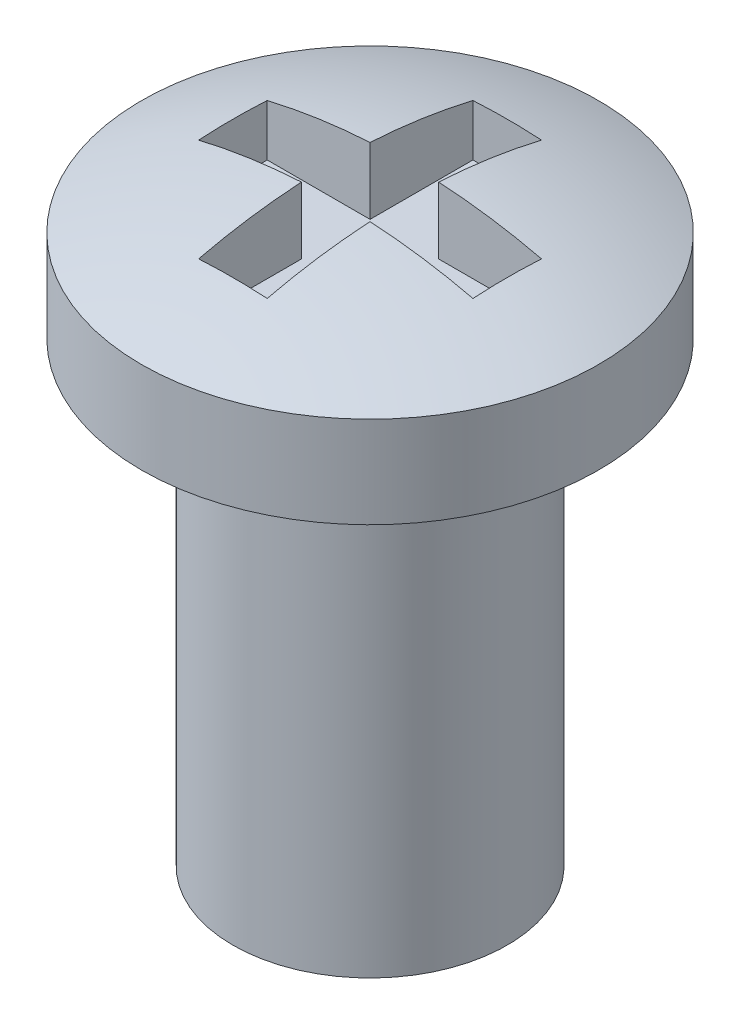
ISO-10303-21;
HEADER;
FILE_DESCRIPTION(('STEP AP214'),'2;1');
FILE_NAME('part.step','',(''),(''),'','','');
FILE_SCHEMA(('AUTOMOTIVE_DESIGN { 1 0 10303 214 1 1 1 1 }'));
ENDSEC;
DATA;
#1=APPLICATION_CONTEXT('core data for automotive mechanical design processes');
#2=APPLICATION_PROTOCOL_DEFINITION('international standard','automotive_design',2000,#1);
#3=PRODUCT_CONTEXT('',#1,'mechanical');
#4=PRODUCT('Part','Part','',(#3));
#5=PRODUCT_RELATED_PRODUCT_CATEGORY('part','',(#4));
#6=PRODUCT_DEFINITION_FORMATION('','',#4);
#7=PRODUCT_DEFINITION_CONTEXT('part definition',#1,'design');
#8=PRODUCT_DEFINITION('design','',#6,#7);
#9=PRODUCT_DEFINITION_SHAPE('','',#8);
#10=(LENGTH_UNIT() NAMED_UNIT(*) SI_UNIT(.MILLI.,.METRE.));
#11=(NAMED_UNIT(*) PLANE_ANGLE_UNIT() SI_UNIT($,.RADIAN.));
#12=(NAMED_UNIT(*) SI_UNIT($,.STERADIAN.) SOLID_ANGLE_UNIT());
#13=UNCERTAINTY_MEASURE_WITH_UNIT(LENGTH_MEASURE(1.E-05),#10,'distance_accuracy_value','');
#14=(GEOMETRIC_REPRESENTATION_CONTEXT(3) GLOBAL_UNCERTAINTY_ASSIGNED_CONTEXT((#13)) GLOBAL_UNIT_ASSIGNED_CONTEXT((#10,
#11,#12)) REPRESENTATION_CONTEXT('',''));
#15=CARTESIAN_POINT('',(0.,0.,0.));
#16=DIRECTION('',(0.,0.,1.));
#17=DIRECTION('',(1.,0.,0.));
#18=AXIS2_PLACEMENT_3D('',#15,#16,#17);
#19=CARTESIAN_POINT('',(0.,5.,0.));
#20=DIRECTION('',(0.,-1.,0.));
#21=DIRECTION('',(0.,0.,-1.));
#22=AXIS2_PLACEMENT_3D('',#19,#20,#21);
#23=CYLINDRICAL_SURFACE('',#22,1.5);
#24=CARTESIAN_POINT('',(0.,5.,0.));
#25=DIRECTION('',(0.,1.,0.));
#26=DIRECTION('',(0.,0.,1.));
#27=AXIS2_PLACEMENT_3D('',#24,#25,#26);
#28=CIRCLE('',#27,1.5);
#29=CARTESIAN_POINT('',(0.,5.,1.5));
#30=VERTEX_POINT('',#29);
#31=EDGE_CURVE('E197',#30,#30,#28,.T.);
#32=ORIENTED_EDGE('',*,*,#31,.F.);
#33=EDGE_LOOP('',(#32));
#34=FACE_BOUND('',#33,.T.);
#35=CARTESIAN_POINT('',(0.,0.,0.));
#36=DIRECTION('',(0.,1.,0.));
#37=DIRECTION('',(0.,0.,1.));
#38=AXIS2_PLACEMENT_3D('',#35,#36,#37);
#39=CIRCLE('',#38,1.5);
#40=CARTESIAN_POINT('',(0.,0.,1.5));
#41=VERTEX_POINT('',#40);
#42=EDGE_CURVE('E201',#41,#41,#39,.T.);
#43=ORIENTED_EDGE('',*,*,#42,.T.);
#44=EDGE_LOOP('',(#43));
#45=FACE_BOUND('',#44,.T.);
#46=ADVANCED_FACE('F34',(#34,#45),#23,.T.);
#47=CARTESIAN_POINT('',(0.,0.,0.));
#48=DIRECTION('',(0.,1.,0.));
#49=DIRECTION('',(0.,0.,1.));
#50=AXIS2_PLACEMENT_3D('',#47,#48,#49);
#51=PLANE('',#50);
#52=ORIENTED_EDGE('',*,*,#42,.F.);
#53=EDGE_LOOP('',(#52));
#54=FACE_BOUND('',#53,.T.);
#55=ADVANCED_FACE('F275',(#54),#51,.F.);
#56=CARTESIAN_POINT('',(0.,6.,0.));
#57=DIRECTION('',(0.,-1.,0.));
#58=DIRECTION('',(0.,0.,-1.));
#59=AXIS2_PLACEMENT_3D('',#56,#57,#58);
#60=CYLINDRICAL_SURFACE('',#59,2.5);
#61=CARTESIAN_POINT('',(0.,6.,0.));
#62=DIRECTION('',(0.,1.,0.));
#63=DIRECTION('',(0.,0.,1.));
#64=AXIS2_PLACEMENT_3D('',#61,#62,#63);
#65=CIRCLE('',#64,2.5);
#66=CARTESIAN_POINT('',(0.,6.,2.5));
#67=VERTEX_POINT('',#66);
#68=EDGE_CURVE('E196',#67,#67,#65,.T.);
#69=ORIENTED_EDGE('',*,*,#68,.F.);
#70=EDGE_LOOP('',(#69));
#71=FACE_BOUND('',#70,.T.);
#72=CARTESIAN_POINT('',(0.,5.,0.));
#73=DIRECTION('',(0.,1.,0.));
#74=DIRECTION('',(0.,0.,1.));
#75=AXIS2_PLACEMENT_3D('',#72,#73,#74);
#76=CIRCLE('',#75,2.5);
#77=CARTESIAN_POINT('',(0.,5.,2.5));
#78=VERTEX_POINT('',#77);
#79=EDGE_CURVE('E166',#78,#78,#76,.T.);
#80=ORIENTED_EDGE('',*,*,#79,.T.);
#81=EDGE_LOOP('',(#80));
#82=FACE_BOUND('',#81,.T.);
#83=ADVANCED_FACE('F280',(#71,#82),#60,.T.);
#84=CARTESIAN_POINT('',(0.,0.,0.));
#85=DIRECTION('',(0.,0.,1.));
#86=DIRECTION('',(1.,0.,0.));
#87=AXIS2_PLACEMENT_3D('',#84,#85,#86);
#88=SPHERICAL_SURFACE('',#87,6.49999999999999);
#89=CARTESIAN_POINT('',(0.,0.,0.375));
#90=DIRECTION('',(0.,0.,1.));
#91=DIRECTION('',(1.,0.,0.));
#92=AXIS2_PLACEMENT_3D('',#89,#90,#91);
#93=CIRCLE('',#92,6.4891736762087);
#94=CARTESIAN_POINT('',(-1.5,6.3134281495872,0.375));
#95=VERTEX_POINT('',#94);
#96=CARTESIAN_POINT('',(-0.375,6.47832925992497,0.375));
#97=VERTEX_POINT('',#96);
#98=EDGE_CURVE('E11',#95,#97,#93,.F.);
#99=ORIENTED_EDGE('',*,*,#98,.F.);
#100=CARTESIAN_POINT('',(-1.5,0.,0.));
#101=DIRECTION('',(-1.,0.,0.));
#102=DIRECTION('',(0.,0.,1.));
#103=AXIS2_PLACEMENT_3D('',#100,#101,#102);
#104=CIRCLE('',#103,6.32455532033675);
#105=CARTESIAN_POINT('',(-1.5,6.3134281495872,-0.375));
#106=VERTEX_POINT('',#105);
#107=EDGE_CURVE('E42',#106,#95,#104,.F.);
#108=ORIENTED_EDGE('',*,*,#107,.F.);
#109=CARTESIAN_POINT('',(0.,0.,-0.375));
#110=DIRECTION('',(0.,0.,1.));
#111=DIRECTION('',(1.,0.,0.));
#112=AXIS2_PLACEMENT_3D('',#109,#110,#111);
#113=CIRCLE('',#112,6.4891736762087);
#114=CARTESIAN_POINT('',(-0.375,6.47832925992497,-0.375));
#115=VERTEX_POINT('',#114);
#116=EDGE_CURVE('E228',#106,#115,#113,.F.);
#117=ORIENTED_EDGE('',*,*,#116,.T.);
#118=CARTESIAN_POINT('',(-0.375,0.,0.));
#119=DIRECTION('',(-1.,0.,0.));
#120=DIRECTION('',(0.,0.,1.));
#121=AXIS2_PLACEMENT_3D('',#118,#119,#120);
#122=CIRCLE('',#121,6.4891736762087);
#123=CARTESIAN_POINT('',(-0.375,6.3134281495872,-1.5));
#124=VERTEX_POINT('',#123);
#125=EDGE_CURVE('E226',#124,#115,#122,.F.);
#126=ORIENTED_EDGE('',*,*,#125,.F.);
#127=CARTESIAN_POINT('',(0.,0.,-1.5));
#128=DIRECTION('',(0.,0.,1.));
#129=DIRECTION('',(1.,0.,0.));
#130=AXIS2_PLACEMENT_3D('',#127,#128,#129);
#131=CIRCLE('',#130,6.32455532033675);
#132=CARTESIAN_POINT('',(0.375,6.3134281495872,-1.5));
#133=VERTEX_POINT('',#132);
#134=EDGE_CURVE('E223',#124,#133,#131,.F.);
#135=ORIENTED_EDGE('',*,*,#134,.T.);
#136=CARTESIAN_POINT('',(0.375,0.,0.));
#137=DIRECTION('',(-1.,0.,0.));
#138=DIRECTION('',(0.,0.,1.));
#139=AXIS2_PLACEMENT_3D('',#136,#137,#138);
#140=CIRCLE('',#139,6.4891736762087);
#141=CARTESIAN_POINT('',(0.375,6.47832925992497,-0.375));
#142=VERTEX_POINT('',#141);
#143=EDGE_CURVE('E220',#133,#142,#140,.F.);
#144=ORIENTED_EDGE('',*,*,#143,.T.);
#145=CARTESIAN_POINT('',(0.,0.,-0.375));
#146=DIRECTION('',(0.,0.,1.));
#147=DIRECTION('',(1.,0.,0.));
#148=AXIS2_PLACEMENT_3D('',#145,#146,#147);
#149=CIRCLE('',#148,6.4891736762087);
#150=CARTESIAN_POINT('',(1.5,6.3134281495872,-0.375));
#151=VERTEX_POINT('',#150);
#152=EDGE_CURVE('E217',#142,#151,#149,.F.);
#153=ORIENTED_EDGE('',*,*,#152,.T.);
#154=CARTESIAN_POINT('',(1.5,0.,0.));
#155=DIRECTION('',(-1.,0.,0.));
#156=DIRECTION('',(0.,0.,1.));
#157=AXIS2_PLACEMENT_3D('',#154,#155,#156);
#158=CIRCLE('',#157,6.32455532033675);
#159=CARTESIAN_POINT('',(1.5,6.3134281495872,0.375));
#160=VERTEX_POINT('',#159);
#161=EDGE_CURVE('E214',#151,#160,#158,.F.);
#162=ORIENTED_EDGE('',*,*,#161,.T.);
#163=CARTESIAN_POINT('',(0.,0.,0.375));
#164=DIRECTION('',(0.,0.,1.));
#165=DIRECTION('',(1.,0.,0.));
#166=AXIS2_PLACEMENT_3D('',#163,#164,#165);
#167=CIRCLE('',#166,6.4891736762087);
#168=CARTESIAN_POINT('',(0.375,6.47832925992497,0.375));
#169=VERTEX_POINT('',#168);
#170=EDGE_CURVE('E212',#169,#160,#167,.F.);
#171=ORIENTED_EDGE('',*,*,#170,.F.);
#172=CARTESIAN_POINT('',(0.375,0.,0.));
#173=DIRECTION('',(-1.,0.,0.));
#174=DIRECTION('',(0.,0.,1.));
#175=AXIS2_PLACEMENT_3D('',#172,#173,#174);
#176=CIRCLE('',#175,6.4891736762087);
#177=CARTESIAN_POINT('',(0.375,6.3134281495872,1.5));
#178=VERTEX_POINT('',#177);
#179=EDGE_CURVE('E209',#169,#178,#176,.F.);
#180=ORIENTED_EDGE('',*,*,#179,.T.);
#181=CARTESIAN_POINT('',(0.,0.,1.5));
#182=DIRECTION('',(0.,0.,1.));
#183=DIRECTION('',(1.,0.,0.));
#184=AXIS2_PLACEMENT_3D('',#181,#182,#183);
#185=CIRCLE('',#184,6.32455532033675);
#186=CARTESIAN_POINT('',(-0.375,6.3134281495872,1.5));
#187=VERTEX_POINT('',#186);
#188=EDGE_CURVE('E207',#187,#178,#185,.F.);
#189=ORIENTED_EDGE('',*,*,#188,.F.);
#190=CARTESIAN_POINT('',(-0.375,0.,0.));
#191=DIRECTION('',(-1.,0.,0.));
#192=DIRECTION('',(0.,0.,1.));
#193=AXIS2_PLACEMENT_3D('',#190,#191,#192);
#194=CIRCLE('',#193,6.4891736762087);
#195=EDGE_CURVE('E200',#97,#187,#194,.F.);
#196=ORIENTED_EDGE('',*,*,#195,.F.);
#197=EDGE_LOOP('',(#99,#108,#117,#126,#135,#144,#153,#162,#171,#180,#189,#196));
#198=FACE_BOUND('',#197,.T.);
#199=ORIENTED_EDGE('',*,*,#68,.T.);
#200=EDGE_LOOP('',(#199));
#201=FACE_BOUND('',#200,.T.);
#202=ADVANCED_FACE('F36',(#198,#201),#88,.T.);
#203=CARTESIAN_POINT('',(0.,5.,0.));
#204=DIRECTION('',(0.,1.,0.));
#205=DIRECTION('',(0.,0.,1.));
#206=AXIS2_PLACEMENT_3D('',#203,#204,#205);
#207=PLANE('',#206);
#208=ORIENTED_EDGE('',*,*,#31,.T.);
#209=EDGE_LOOP('',(#208));
#210=FACE_BOUND('',#209,.T.);
#211=ORIENTED_EDGE('',*,*,#79,.F.);
#212=EDGE_LOOP('',(#211));
#213=FACE_BOUND('',#212,.T.);
#214=ADVANCED_FACE('F289',(#210,#213),#207,.F.);
#215=CARTESIAN_POINT('',(0.,5.75,0.375));
#216=DIRECTION('',(0.,0.,1.));
#217=DIRECTION('',(1.,0.,0.));
#218=AXIS2_PLACEMENT_3D('',#215,#216,#217);
#219=PLANE('',#218);
#220=ORIENTED_EDGE('',*,*,#98,.T.);
#221=DIRECTION('',(0.,1.,0.));
#222=VECTOR('',#221,1.);
#223=CARTESIAN_POINT('',(-0.375,5.75,0.375));
#224=LINE('',#223,#222);
#225=CARTESIAN_POINT('',(-0.375,5.75,0.375));
#226=VERTEX_POINT('',#225);
#227=EDGE_CURVE('E49',#226,#97,#224,.T.);
#228=ORIENTED_EDGE('',*,*,#227,.F.);
#229=DIRECTION('',(1.,0.,0.));
#230=VECTOR('',#229,1.);
#231=CARTESIAN_POINT('',(0.,5.75,0.375));
#232=LINE('',#231,#230);
#233=CARTESIAN_POINT('',(-1.5,5.75,0.375));
#234=VERTEX_POINT('',#233);
#235=EDGE_CURVE('E123',#234,#226,#232,.T.);
#236=ORIENTED_EDGE('',*,*,#235,.F.);
#237=DIRECTION('',(0.,1.,0.));
#238=VECTOR('',#237,1.);
#239=CARTESIAN_POINT('',(-1.5,5.75,0.375));
#240=LINE('',#239,#238);
#241=EDGE_CURVE('E164',#234,#95,#240,.T.);
#242=ORIENTED_EDGE('',*,*,#241,.T.);
#243=EDGE_LOOP('',(#220,#228,#236,#242));
#244=FACE_BOUND('',#243,.T.);
#245=ADVANCED_FACE('F121',(#244),#219,.F.);
#246=CARTESIAN_POINT('',(-1.5,5.75,0.));
#247=DIRECTION('',(-1.,0.,0.));
#248=DIRECTION('',(0.,0.,1.));
#249=AXIS2_PLACEMENT_3D('',#246,#247,#248);
#250=PLANE('',#249);
#251=ORIENTED_EDGE('',*,*,#107,.T.);
#252=ORIENTED_EDGE('',*,*,#241,.F.);
#253=DIRECTION('',(0.,0.,1.));
#254=VECTOR('',#253,1.);
#255=CARTESIAN_POINT('',(-1.5,5.75,0.));
#256=LINE('',#255,#254);
#257=CARTESIAN_POINT('',(-1.5,5.75,-0.375));
#258=VERTEX_POINT('',#257);
#259=EDGE_CURVE('E128',#258,#234,#256,.T.);
#260=ORIENTED_EDGE('',*,*,#259,.F.);
#261=DIRECTION('',(0.,1.,0.));
#262=VECTOR('',#261,1.);
#263=CARTESIAN_POINT('',(-1.5,5.75,-0.375));
#264=LINE('',#263,#262);
#265=EDGE_CURVE('E167',#258,#106,#264,.T.);
#266=ORIENTED_EDGE('',*,*,#265,.T.);
#267=EDGE_LOOP('',(#251,#252,#260,#266));
#268=FACE_BOUND('',#267,.T.);
#269=ADVANCED_FACE('F236',(#268),#250,.F.);
#270=CARTESIAN_POINT('',(0.,5.75,-0.375));
#271=DIRECTION('',(0.,0.,1.));
#272=DIRECTION('',(1.,0.,0.));
#273=AXIS2_PLACEMENT_3D('',#270,#271,#272);
#274=PLANE('',#273);
#275=ORIENTED_EDGE('',*,*,#265,.F.);
#276=DIRECTION('',(1.,0.,0.));
#277=VECTOR('',#276,1.);
#278=CARTESIAN_POINT('',(0.,5.75,-0.375));
#279=LINE('',#278,#277);
#280=CARTESIAN_POINT('',(-0.375,5.75,-0.375));
#281=VERTEX_POINT('',#280);
#282=EDGE_CURVE('E161',#258,#281,#279,.T.);
#283=ORIENTED_EDGE('',*,*,#282,.T.);
#284=DIRECTION('',(0.,1.,0.));
#285=VECTOR('',#284,1.);
#286=CARTESIAN_POINT('',(-0.375,5.75,-0.375));
#287=LINE('',#286,#285);
#288=EDGE_CURVE('E169',#281,#115,#287,.T.);
#289=ORIENTED_EDGE('',*,*,#288,.T.);
#290=ORIENTED_EDGE('',*,*,#116,.F.);
#291=EDGE_LOOP('',(#275,#283,#289,#290));
#292=FACE_BOUND('',#291,.T.);
#293=ADVANCED_FACE('F234',(#292),#274,.T.);
#294=CARTESIAN_POINT('',(-0.375,5.75,0.));
#295=DIRECTION('',(-1.,0.,0.));
#296=DIRECTION('',(0.,0.,1.));
#297=AXIS2_PLACEMENT_3D('',#294,#295,#296);
#298=PLANE('',#297);
#299=ORIENTED_EDGE('',*,*,#125,.T.);
#300=ORIENTED_EDGE('',*,*,#288,.F.);
#301=DIRECTION('',(0.,0.,1.));
#302=VECTOR('',#301,1.);
#303=CARTESIAN_POINT('',(-0.375,5.75,0.));
#304=LINE('',#303,#302);
#305=CARTESIAN_POINT('',(-0.375,5.75,-1.5));
#306=VERTEX_POINT('',#305);
#307=EDGE_CURVE('E158',#306,#281,#304,.T.);
#308=ORIENTED_EDGE('',*,*,#307,.F.);
#309=DIRECTION('',(0.,1.,0.));
#310=VECTOR('',#309,1.);
#311=CARTESIAN_POINT('',(-0.375,5.75,-1.5));
#312=LINE('',#311,#310);
#313=EDGE_CURVE('E172',#306,#124,#312,.T.);
#314=ORIENTED_EDGE('',*,*,#313,.T.);
#315=EDGE_LOOP('',(#299,#300,#308,#314));
#316=FACE_BOUND('',#315,.T.);
#317=ADVANCED_FACE('F264',(#316),#298,.F.);
#318=CARTESIAN_POINT('',(0.,5.75,-1.5));
#319=DIRECTION('',(0.,0.,1.));
#320=DIRECTION('',(1.,0.,0.));
#321=AXIS2_PLACEMENT_3D('',#318,#319,#320);
#322=PLANE('',#321);
#323=ORIENTED_EDGE('',*,*,#313,.F.);
#324=DIRECTION('',(1.,0.,0.));
#325=VECTOR('',#324,1.);
#326=CARTESIAN_POINT('',(0.,5.75,-1.5));
#327=LINE('',#326,#325);
#328=CARTESIAN_POINT('',(0.375,5.75,-1.5));
#329=VERTEX_POINT('',#328);
#330=EDGE_CURVE('E156',#306,#329,#327,.T.);
#331=ORIENTED_EDGE('',*,*,#330,.T.);
#332=DIRECTION('',(0.,1.,0.));
#333=VECTOR('',#332,1.);
#334=CARTESIAN_POINT('',(0.375,5.75,-1.5));
#335=LINE('',#334,#333);
#336=EDGE_CURVE('E175',#329,#133,#335,.T.);
#337=ORIENTED_EDGE('',*,*,#336,.T.);
#338=ORIENTED_EDGE('',*,*,#134,.F.);
#339=EDGE_LOOP('',(#323,#331,#337,#338));
#340=FACE_BOUND('',#339,.T.);
#341=ADVANCED_FACE('F265',(#340),#322,.T.);
#342=CARTESIAN_POINT('',(0.375,5.75,0.));
#343=DIRECTION('',(-1.,0.,0.));
#344=DIRECTION('',(0.,0.,1.));
#345=AXIS2_PLACEMENT_3D('',#342,#343,#344);
#346=PLANE('',#345);
#347=ORIENTED_EDGE('',*,*,#336,.F.);
#348=DIRECTION('',(0.,0.,1.));
#349=VECTOR('',#348,1.);
#350=CARTESIAN_POINT('',(0.375,5.75,0.));
#351=LINE('',#350,#349);
#352=CARTESIAN_POINT('',(0.375,5.75,-0.375));
#353=VERTEX_POINT('',#352);
#354=EDGE_CURVE('E154',#329,#353,#351,.T.);
#355=ORIENTED_EDGE('',*,*,#354,.T.);
#356=DIRECTION('',(0.,1.,0.));
#357=VECTOR('',#356,1.);
#358=CARTESIAN_POINT('',(0.375,5.75,-0.375));
#359=LINE('',#358,#357);
#360=EDGE_CURVE('E178',#353,#142,#359,.T.);
#361=ORIENTED_EDGE('',*,*,#360,.T.);
#362=ORIENTED_EDGE('',*,*,#143,.F.);
#363=EDGE_LOOP('',(#347,#355,#361,#362));
#364=FACE_BOUND('',#363,.T.);
#365=ADVANCED_FACE('F258',(#364),#346,.T.);
#366=CARTESIAN_POINT('',(0.,5.75,-0.375));
#367=DIRECTION('',(0.,0.,1.));
#368=DIRECTION('',(1.,0.,0.));
#369=AXIS2_PLACEMENT_3D('',#366,#367,#368);
#370=PLANE('',#369);
#371=ORIENTED_EDGE('',*,*,#360,.F.);
#372=DIRECTION('',(1.,0.,0.));
#373=VECTOR('',#372,1.);
#374=CARTESIAN_POINT('',(0.,5.75,-0.375));
#375=LINE('',#374,#373);
#376=CARTESIAN_POINT('',(1.5,5.75,-0.375));
#377=VERTEX_POINT('',#376);
#378=EDGE_CURVE('E152',#353,#377,#375,.T.);
#379=ORIENTED_EDGE('',*,*,#378,.T.);
#380=DIRECTION('',(0.,1.,0.));
#381=VECTOR('',#380,1.);
#382=CARTESIAN_POINT('',(1.5,5.75,-0.375));
#383=LINE('',#382,#381);
#384=EDGE_CURVE('E181',#377,#151,#383,.T.);
#385=ORIENTED_EDGE('',*,*,#384,.T.);
#386=ORIENTED_EDGE('',*,*,#152,.F.);
#387=EDGE_LOOP('',(#371,#379,#385,#386));
#388=FACE_BOUND('',#387,.T.);
#389=ADVANCED_FACE('F254',(#388),#370,.T.);
#390=CARTESIAN_POINT('',(1.5,5.75,0.));
#391=DIRECTION('',(-1.,0.,0.));
#392=DIRECTION('',(0.,0.,1.));
#393=AXIS2_PLACEMENT_3D('',#390,#391,#392);
#394=PLANE('',#393);
#395=ORIENTED_EDGE('',*,*,#384,.F.);
#396=DIRECTION('',(0.,0.,1.));
#397=VECTOR('',#396,1.);
#398=CARTESIAN_POINT('',(1.5,5.75,0.));
#399=LINE('',#398,#397);
#400=CARTESIAN_POINT('',(1.5,5.75,0.375));
#401=VERTEX_POINT('',#400);
#402=EDGE_CURVE('E150',#377,#401,#399,.T.);
#403=ORIENTED_EDGE('',*,*,#402,.T.);
#404=DIRECTION('',(0.,1.,0.));
#405=VECTOR('',#404,1.);
#406=CARTESIAN_POINT('',(1.5,5.75,0.375));
#407=LINE('',#406,#405);
#408=EDGE_CURVE('E184',#401,#160,#407,.T.);
#409=ORIENTED_EDGE('',*,*,#408,.T.);
#410=ORIENTED_EDGE('',*,*,#161,.F.);
#411=EDGE_LOOP('',(#395,#403,#409,#410));
#412=FACE_BOUND('',#411,.T.);
#413=ADVANCED_FACE('F251',(#412),#394,.T.);
#414=CARTESIAN_POINT('',(0.,5.75,0.375));
#415=DIRECTION('',(0.,0.,1.));
#416=DIRECTION('',(1.,0.,0.));
#417=AXIS2_PLACEMENT_3D('',#414,#415,#416);
#418=PLANE('',#417);
#419=ORIENTED_EDGE('',*,*,#170,.T.);
#420=ORIENTED_EDGE('',*,*,#408,.F.);
#421=DIRECTION('',(1.,0.,0.));
#422=VECTOR('',#421,1.);
#423=CARTESIAN_POINT('',(0.,5.75,0.375));
#424=LINE('',#423,#422);
#425=CARTESIAN_POINT('',(0.375,5.75,0.375));
#426=VERTEX_POINT('',#425);
#427=EDGE_CURVE('E147',#426,#401,#424,.T.);
#428=ORIENTED_EDGE('',*,*,#427,.F.);
#429=DIRECTION('',(0.,1.,0.));
#430=VECTOR('',#429,1.);
#431=CARTESIAN_POINT('',(0.375,5.75,0.375));
#432=LINE('',#431,#430);
#433=EDGE_CURVE('E187',#426,#169,#432,.T.);
#434=ORIENTED_EDGE('',*,*,#433,.T.);
#435=EDGE_LOOP('',(#419,#420,#428,#434));
#436=FACE_BOUND('',#435,.T.);
#437=ADVANCED_FACE('F247',(#436),#418,.F.);
#438=CARTESIAN_POINT('',(0.375,5.75,0.));
#439=DIRECTION('',(-1.,0.,0.));
#440=DIRECTION('',(0.,0.,1.));
#441=AXIS2_PLACEMENT_3D('',#438,#439,#440);
#442=PLANE('',#441);
#443=ORIENTED_EDGE('',*,*,#433,.F.);
#444=DIRECTION('',(0.,0.,1.));
#445=VECTOR('',#444,1.);
#446=CARTESIAN_POINT('',(0.375,5.75,0.));
#447=LINE('',#446,#445);
#448=CARTESIAN_POINT('',(0.375,5.75,1.5));
#449=VERTEX_POINT('',#448);
#450=EDGE_CURVE('E145',#426,#449,#447,.T.);
#451=ORIENTED_EDGE('',*,*,#450,.T.);
#452=DIRECTION('',(0.,1.,0.));
#453=VECTOR('',#452,1.);
#454=CARTESIAN_POINT('',(0.375,5.75,1.5));
#455=LINE('',#454,#453);
#456=EDGE_CURVE('E190',#449,#178,#455,.T.);
#457=ORIENTED_EDGE('',*,*,#456,.T.);
#458=ORIENTED_EDGE('',*,*,#179,.F.);
#459=EDGE_LOOP('',(#443,#451,#457,#458));
#460=FACE_BOUND('',#459,.T.);
#461=ADVANCED_FACE('F299',(#460),#442,.T.);
#462=CARTESIAN_POINT('',(0.,5.75,1.5));
#463=DIRECTION('',(0.,0.,1.));
#464=DIRECTION('',(1.,0.,0.));
#465=AXIS2_PLACEMENT_3D('',#462,#463,#464);
#466=PLANE('',#465);
#467=ORIENTED_EDGE('',*,*,#188,.T.);
#468=ORIENTED_EDGE('',*,*,#456,.F.);
#469=DIRECTION('',(1.,0.,0.));
#470=VECTOR('',#469,1.);
#471=CARTESIAN_POINT('',(0.,5.75,1.5));
#472=LINE('',#471,#470);
#473=CARTESIAN_POINT('',(-0.375,5.75,1.5));
#474=VERTEX_POINT('',#473);
#475=EDGE_CURVE('E137',#474,#449,#472,.T.);
#476=ORIENTED_EDGE('',*,*,#475,.F.);
#477=DIRECTION('',(0.,1.,0.));
#478=VECTOR('',#477,1.);
#479=CARTESIAN_POINT('',(-0.375,5.75,1.5));
#480=LINE('',#479,#478);
#481=EDGE_CURVE('E127',#474,#187,#480,.T.);
#482=ORIENTED_EDGE('',*,*,#481,.T.);
#483=EDGE_LOOP('',(#467,#468,#476,#482));
#484=FACE_BOUND('',#483,.T.);
#485=ADVANCED_FACE('F239',(#484),#466,.F.);
#486=CARTESIAN_POINT('',(-0.375,5.75,0.));
#487=DIRECTION('',(-1.,0.,0.));
#488=DIRECTION('',(0.,0.,1.));
#489=AXIS2_PLACEMENT_3D('',#486,#487,#488);
#490=PLANE('',#489);
#491=ORIENTED_EDGE('',*,*,#195,.T.);
#492=ORIENTED_EDGE('',*,*,#481,.F.);
#493=DIRECTION('',(0.,0.,1.));
#494=VECTOR('',#493,1.);
#495=CARTESIAN_POINT('',(-0.375,5.75,0.));
#496=LINE('',#495,#494);
#497=EDGE_CURVE('E131',#226,#474,#496,.T.);
#498=ORIENTED_EDGE('',*,*,#497,.F.);
#499=ORIENTED_EDGE('',*,*,#227,.T.);
#500=EDGE_LOOP('',(#491,#492,#498,#499));
#501=FACE_BOUND('',#500,.T.);
#502=ADVANCED_FACE('F132',(#501),#490,.F.);
#503=CARTESIAN_POINT('',(0.,5.75,0.));
#504=DIRECTION('',(0.,1.,0.));
#505=DIRECTION('',(0.,0.,1.));
#506=AXIS2_PLACEMENT_3D('',#503,#504,#505);
#507=PLANE('',#506);
#508=ORIENTED_EDGE('',*,*,#235,.T.);
#509=ORIENTED_EDGE('',*,*,#497,.T.);
#510=ORIENTED_EDGE('',*,*,#475,.T.);
#511=ORIENTED_EDGE('',*,*,#450,.F.);
#512=ORIENTED_EDGE('',*,*,#427,.T.);
#513=ORIENTED_EDGE('',*,*,#402,.F.);
#514=ORIENTED_EDGE('',*,*,#378,.F.);
#515=ORIENTED_EDGE('',*,*,#354,.F.);
#516=ORIENTED_EDGE('',*,*,#330,.F.);
#517=ORIENTED_EDGE('',*,*,#307,.T.);
#518=ORIENTED_EDGE('',*,*,#282,.F.);
#519=ORIENTED_EDGE('',*,*,#259,.T.);
#520=EDGE_LOOP('',(#508,#509,#510,#511,#512,#513,#514,#515,#516,#517,#518,#519));
#521=FACE_BOUND('',#520,.T.);
#522=ADVANCED_FACE('F139',(#521),#507,.T.);
#523=CLOSED_SHELL('',(#46,#55,#83,#202,#214,#245,#269,#293,#317,#341,#365,#389,#413,#437,#461,
#485,#502,#522));
#524=MANIFOLD_SOLID_BREP('B2',#523);
#525=ADVANCED_BREP_SHAPE_REPRESENTATION('',(#18,#524),#14);
#526=SHAPE_DEFINITION_REPRESENTATION(#9,#525);
ENDSEC;
END-ISO-10303-21;
